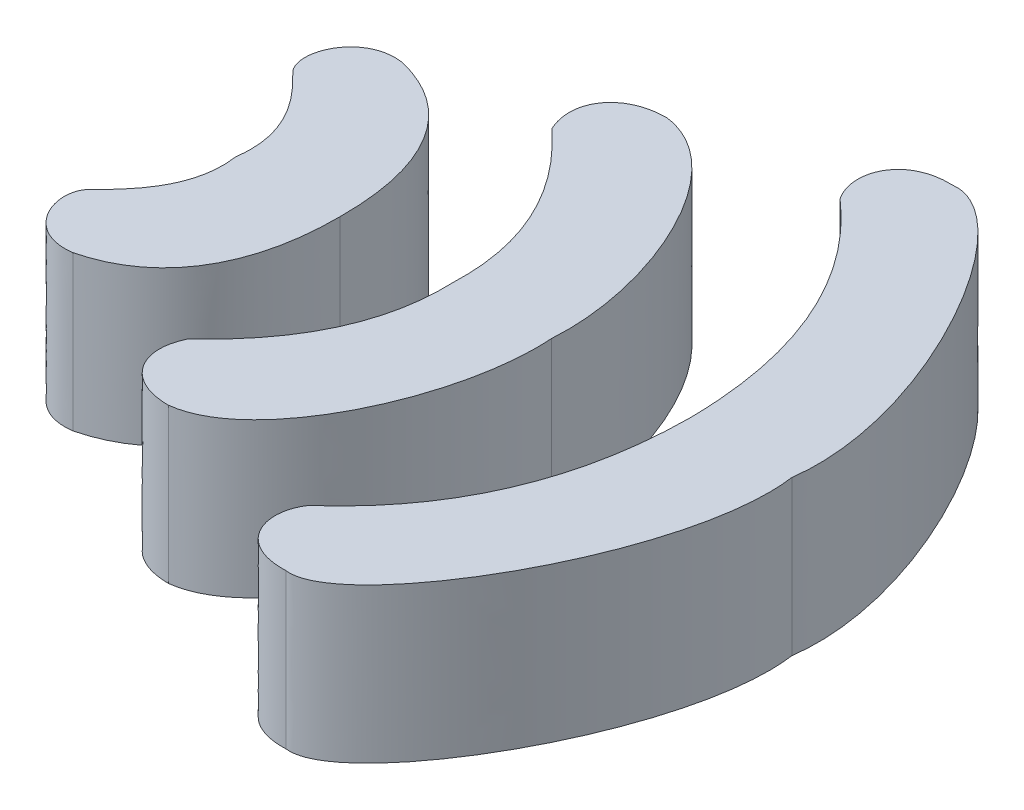
ISO-10303-21;
HEADER;
FILE_DESCRIPTION(('STEP AP214'),'2;1');
FILE_NAME('part.step','',(''),(''),'','','');
FILE_SCHEMA(('AUTOMOTIVE_DESIGN { 1 0 10303 214 1 1 1 1 }'));
ENDSEC;
DATA;
#1=APPLICATION_CONTEXT('core data for automotive mechanical design processes');
#2=APPLICATION_PROTOCOL_DEFINITION('international standard','automotive_design',2000,#1);
#3=PRODUCT_CONTEXT('',#1,'mechanical');
#4=PRODUCT('Part','Part','',(#3));
#5=PRODUCT_RELATED_PRODUCT_CATEGORY('part','',(#4));
#6=PRODUCT_DEFINITION_FORMATION('','',#4);
#7=PRODUCT_DEFINITION_CONTEXT('part definition',#1,'design');
#8=PRODUCT_DEFINITION('design','',#6,#7);
#9=PRODUCT_DEFINITION_SHAPE('','',#8);
#10=(LENGTH_UNIT() NAMED_UNIT(*) SI_UNIT(.MILLI.,.METRE.));
#11=(NAMED_UNIT(*) PLANE_ANGLE_UNIT() SI_UNIT($,.RADIAN.));
#12=(NAMED_UNIT(*) SI_UNIT($,.STERADIAN.) SOLID_ANGLE_UNIT());
#13=UNCERTAINTY_MEASURE_WITH_UNIT(LENGTH_MEASURE(1.E-05),#10,'distance_accuracy_value','');
#14=(GEOMETRIC_REPRESENTATION_CONTEXT(3) GLOBAL_UNCERTAINTY_ASSIGNED_CONTEXT((#13)) GLOBAL_UNIT_ASSIGNED_CONTEXT((#10,
#11,#12)) REPRESENTATION_CONTEXT('',''));
#15=CARTESIAN_POINT('',(0.,0.,0.));
#16=DIRECTION('',(0.,0.,1.));
#17=DIRECTION('',(1.,0.,0.));
#18=AXIS2_PLACEMENT_3D('',#15,#16,#17);
#19=CARTESIAN_POINT('',(7.42126006215926,2.,-5.05579621304999));
#20=CARTESIAN_POINT('',(7.41057557473069,2.,-3.71253404907121));
#21=CARTESIAN_POINT('',(6.96757511777548,2.,-2.52001163881642));
#22=CARTESIAN_POINT('',(5.93694367861275,2.,-1.61821471098783));
#23=B_SPLINE_CURVE_WITH_KNOTS('',3,(#19,#20,#21,#22),.UNSPECIFIED.,.F.,.F.,(4,4),(0.,1.),.UNSPECIFIED.);
#24=DIRECTION('',(0.,-1.,0.));
#25=VECTOR('',#24,1.);
#26=SURFACE_OF_LINEAR_EXTRUSION('',#23,#25);
#27=CARTESIAN_POINT('',(7.42126006215926,0.,-5.05579621304999));
#28=CARTESIAN_POINT('',(7.41057557473069,0.,-3.71253404907121));
#29=CARTESIAN_POINT('',(6.96757511777548,0.,-2.52001163881642));
#30=CARTESIAN_POINT('',(5.93694367861275,0.,-1.61821471098783));
#31=B_SPLINE_CURVE_WITH_KNOTS('',3,(#27,#28,#29,#30),.UNSPECIFIED.,.F.,.F.,(4,4),(0.,1.),.UNSPECIFIED.);
#32=CARTESIAN_POINT('',(7.42126006215926,0.,-5.05579621304999));
#33=VERTEX_POINT('',#32);
#34=CARTESIAN_POINT('',(5.93694367861275,0.,-1.61821471098783));
#35=VERTEX_POINT('',#34);
#36=EDGE_CURVE('E196',#33,#35,#31,.T.);
#37=ORIENTED_EDGE('',*,*,#36,.T.);
#38=DIRECTION('',(0.,-1.,0.));
#39=VECTOR('',#38,1.);
#40=CARTESIAN_POINT('',(5.93694367861275,2.,-1.61821471098783));
#41=LINE('',#40,#39);
#42=CARTESIAN_POINT('',(5.93694367861275,2.,-1.61821471098783));
#43=VERTEX_POINT('',#42);
#44=EDGE_CURVE('E12',#43,#35,#41,.T.);
#45=ORIENTED_EDGE('',*,*,#44,.F.);
#46=CARTESIAN_POINT('',(7.42126006215926,2.,-5.05579621304999));
#47=VERTEX_POINT('',#46);
#48=EDGE_CURVE('E163',#47,#43,#23,.T.);
#49=ORIENTED_EDGE('',*,*,#48,.F.);
#50=DIRECTION('',(0.,-1.,0.));
#51=VECTOR('',#50,1.);
#52=CARTESIAN_POINT('',(7.42126006215926,2.,-5.05579621304999));
#53=LINE('',#52,#51);
#54=EDGE_CURVE('E125',#47,#33,#53,.T.);
#55=ORIENTED_EDGE('',*,*,#54,.T.);
#56=EDGE_LOOP('',(#37,#45,#49,#55));
#57=FACE_BOUND('',#56,.T.);
#58=ADVANCED_FACE('F44',(#57),#26,.F.);
#59=CARTESIAN_POINT('',(5.93694367861275,2.,-1.61821471098783));
#60=CARTESIAN_POINT('',(5.68837602403387,2.,-1.25804337357399));
#61=CARTESIAN_POINT('',(5.87142631166735,2.,-0.707481676595686));
#62=CARTESIAN_POINT('',(6.52004995803424,2.,-0.73432807119694));
#63=B_SPLINE_CURVE_WITH_KNOTS('',3,(#59,#60,#61,#62),.UNSPECIFIED.,.F.,.F.,(4,4),(0.,1.),.UNSPECIFIED.);
#64=DIRECTION('',(0.,-1.,0.));
#65=VECTOR('',#64,1.);
#66=SURFACE_OF_LINEAR_EXTRUSION('',#63,#65);
#67=CARTESIAN_POINT('',(5.93694367861275,0.,-1.61821471098783));
#68=CARTESIAN_POINT('',(5.68837602403387,0.,-1.25804337357399));
#69=CARTESIAN_POINT('',(5.87142631166735,0.,-0.707481676595686));
#70=CARTESIAN_POINT('',(6.52004995803424,0.,-0.73432807119694));
#71=B_SPLINE_CURVE_WITH_KNOTS('',3,(#67,#68,#69,#70),.UNSPECIFIED.,.F.,.F.,(4,4),(0.,1.),.UNSPECIFIED.);
#72=CARTESIAN_POINT('',(6.52004995803424,0.,-0.73432807119694));
#73=VERTEX_POINT('',#72);
#74=EDGE_CURVE('E194',#35,#73,#71,.T.);
#75=ORIENTED_EDGE('',*,*,#74,.T.);
#76=DIRECTION('',(0.,-1.,0.));
#77=VECTOR('',#76,1.);
#78=CARTESIAN_POINT('',(6.52004995803424,2.,-0.73432807119694));
#79=LINE('',#78,#77);
#80=CARTESIAN_POINT('',(6.52004995803424,2.,-0.73432807119694));
#81=VERTEX_POINT('',#80);
#82=EDGE_CURVE('E53',#81,#73,#79,.T.);
#83=ORIENTED_EDGE('',*,*,#82,.F.);
#84=EDGE_CURVE('E98',#43,#81,#63,.T.);
#85=ORIENTED_EDGE('',*,*,#84,.F.);
#86=ORIENTED_EDGE('',*,*,#44,.T.);
#87=EDGE_LOOP('',(#75,#83,#85,#86));
#88=FACE_BOUND('',#87,.T.);
#89=ADVANCED_FACE('F151',(#88),#66,.F.);
#90=CARTESIAN_POINT('',(6.52004995803424,2.,-0.73432807119694));
#91=CARTESIAN_POINT('',(7.33799488998139,2.,-0.629332836639139));
#92=CARTESIAN_POINT('',(8.97470412590936,2.,-3.45586760643739));
#93=CARTESIAN_POINT('',(8.74932735164435,2.,-5.05579621304999));
#94=B_SPLINE_CURVE_WITH_KNOTS('',3,(#90,#91,#92,#93),.UNSPECIFIED.,.F.,.F.,(4,4),(0.,1.),.UNSPECIFIED.);
#95=DIRECTION('',(0.,-1.,0.));
#96=VECTOR('',#95,1.);
#97=SURFACE_OF_LINEAR_EXTRUSION('',#94,#96);
#98=CARTESIAN_POINT('',(6.52004995803424,0.,-0.73432807119694));
#99=CARTESIAN_POINT('',(7.33799488998139,0.,-0.629332836639139));
#100=CARTESIAN_POINT('',(8.97470412590936,0.,-3.45586760643739));
#101=CARTESIAN_POINT('',(8.74932735164435,0.,-5.05579621304999));
#102=B_SPLINE_CURVE_WITH_KNOTS('',3,(#98,#99,#100,#101),.UNSPECIFIED.,.F.,.F.,(4,4),(0.,1.),.UNSPECIFIED.);
#103=CARTESIAN_POINT('',(8.74932735164435,0.,-5.05579621304999));
#104=VERTEX_POINT('',#103);
#105=EDGE_CURVE('E190',#73,#104,#102,.T.);
#106=ORIENTED_EDGE('',*,*,#105,.T.);
#107=DIRECTION('',(0.,-1.,0.));
#108=VECTOR('',#107,1.);
#109=CARTESIAN_POINT('',(8.74932735164435,2.,-5.05579621304999));
#110=LINE('',#109,#108);
#111=CARTESIAN_POINT('',(8.74932735164435,2.,-5.05579621304999));
#112=VERTEX_POINT('',#111);
#113=EDGE_CURVE('E120',#112,#104,#110,.T.);
#114=ORIENTED_EDGE('',*,*,#113,.F.);
#115=EDGE_CURVE('E111',#81,#112,#94,.T.);
#116=ORIENTED_EDGE('',*,*,#115,.F.);
#117=ORIENTED_EDGE('',*,*,#82,.T.);
#118=EDGE_LOOP('',(#106,#114,#116,#117));
#119=FACE_BOUND('',#118,.T.);
#120=ADVANCED_FACE('F149',(#119),#97,.F.);
#121=CARTESIAN_POINT('',(8.74932735164435,2.,-5.05579621304999));
#122=CARTESIAN_POINT('',(8.97470412590936,2.,-6.6557248196626));
#123=CARTESIAN_POINT('',(7.33799488998139,2.,-9.48225958946085));
#124=CARTESIAN_POINT('',(6.52004995803424,2.,-9.37726435490305));
#125=B_SPLINE_CURVE_WITH_KNOTS('',3,(#121,#122,#123,#124),.UNSPECIFIED.,.F.,.F.,(4,4),(0.,1.),.UNSPECIFIED.);
#126=DIRECTION('',(0.,-1.,0.));
#127=VECTOR('',#126,1.);
#128=SURFACE_OF_LINEAR_EXTRUSION('',#125,#127);
#129=CARTESIAN_POINT('',(8.74932735164435,0.,-5.05579621304999));
#130=CARTESIAN_POINT('',(8.97470412590936,0.,-6.6557248196626));
#131=CARTESIAN_POINT('',(7.33799488998139,0.,-9.48225958946085));
#132=CARTESIAN_POINT('',(6.52004995803424,0.,-9.37726435490305));
#133=B_SPLINE_CURVE_WITH_KNOTS('',3,(#129,#130,#131,#132),.UNSPECIFIED.,.F.,.F.,(4,4),(0.,1.),.UNSPECIFIED.);
#134=CARTESIAN_POINT('',(6.52004995803424,0.,-9.37726435490305));
#135=VERTEX_POINT('',#134);
#136=EDGE_CURVE('E119',#104,#135,#133,.T.);
#137=ORIENTED_EDGE('',*,*,#136,.T.);
#138=DIRECTION('',(0.,-1.,0.));
#139=VECTOR('',#138,1.);
#140=CARTESIAN_POINT('',(6.52004995803424,2.,-9.37726435490305));
#141=LINE('',#140,#139);
#142=CARTESIAN_POINT('',(6.52004995803424,2.,-9.37726435490305));
#143=VERTEX_POINT('',#142);
#144=EDGE_CURVE('E116',#143,#135,#141,.T.);
#145=ORIENTED_EDGE('',*,*,#144,.F.);
#146=EDGE_CURVE('E105',#112,#143,#125,.T.);
#147=ORIENTED_EDGE('',*,*,#146,.F.);
#148=ORIENTED_EDGE('',*,*,#113,.T.);
#149=EDGE_LOOP('',(#137,#145,#147,#148));
#150=FACE_BOUND('',#149,.T.);
#151=ADVANCED_FACE('F117',(#150),#128,.F.);
#152=CARTESIAN_POINT('',(6.52004995803424,2.,-9.37726435490305));
#153=CARTESIAN_POINT('',(5.87142631166735,2.,-9.4041107495043));
#154=CARTESIAN_POINT('',(5.68837602403387,2.,-8.853549052526));
#155=CARTESIAN_POINT('',(5.93694367861275,2.,-8.49337771511216));
#156=B_SPLINE_CURVE_WITH_KNOTS('',3,(#152,#153,#154,#155),.UNSPECIFIED.,.F.,.F.,(4,4),(0.,1.),.UNSPECIFIED.);
#157=DIRECTION('',(0.,-1.,0.));
#158=VECTOR('',#157,1.);
#159=SURFACE_OF_LINEAR_EXTRUSION('',#156,#158);
#160=CARTESIAN_POINT('',(6.52004995803424,0.,-9.37726435490305));
#161=CARTESIAN_POINT('',(5.87142631166735,0.,-9.4041107495043));
#162=CARTESIAN_POINT('',(5.68837602403387,0.,-8.853549052526));
#163=CARTESIAN_POINT('',(5.93694367861275,0.,-8.49337771511216));
#164=B_SPLINE_CURVE_WITH_KNOTS('',3,(#160,#161,#162,#163),.UNSPECIFIED.,.F.,.F.,(4,4),(0.,1.),.UNSPECIFIED.);
#165=CARTESIAN_POINT('',(5.93694367861275,0.,-8.49337771511216));
#166=VERTEX_POINT('',#165);
#167=EDGE_CURVE('E84',#135,#166,#164,.T.);
#168=ORIENTED_EDGE('',*,*,#167,.T.);
#169=DIRECTION('',(0.,-1.,0.));
#170=VECTOR('',#169,1.);
#171=CARTESIAN_POINT('',(5.93694367861275,2.,-8.49337771511216));
#172=LINE('',#171,#170);
#173=CARTESIAN_POINT('',(5.93694367861275,2.,-8.49337771511216));
#174=VERTEX_POINT('',#173);
#175=EDGE_CURVE('E121',#174,#166,#172,.T.);
#176=ORIENTED_EDGE('',*,*,#175,.F.);
#177=EDGE_CURVE('E109',#143,#174,#156,.T.);
#178=ORIENTED_EDGE('',*,*,#177,.F.);
#179=ORIENTED_EDGE('',*,*,#144,.T.);
#180=EDGE_LOOP('',(#168,#176,#178,#179));
#181=FACE_BOUND('',#180,.T.);
#182=ADVANCED_FACE('F123',(#181),#159,.F.);
#183=CARTESIAN_POINT('',(5.93694367861275,2.,-8.49337771511216));
#184=CARTESIAN_POINT('',(6.96757511777548,2.,-7.59158078728357));
#185=CARTESIAN_POINT('',(7.41057557473069,2.,-6.39905837702878));
#186=CARTESIAN_POINT('',(7.42126006215926,2.,-5.05579621304999));
#187=B_SPLINE_CURVE_WITH_KNOTS('',3,(#183,#184,#185,#186),.UNSPECIFIED.,.F.,.F.,(4,4),(0.,1.),.UNSPECIFIED.);
#188=DIRECTION('',(0.,-1.,0.));
#189=VECTOR('',#188,1.);
#190=SURFACE_OF_LINEAR_EXTRUSION('',#187,#189);
#191=CARTESIAN_POINT('',(5.93694367861275,0.,-8.49337771511216));
#192=CARTESIAN_POINT('',(6.96757511777548,0.,-7.59158078728357));
#193=CARTESIAN_POINT('',(7.41057557473069,0.,-6.39905837702878));
#194=CARTESIAN_POINT('',(7.42126006215926,0.,-5.05579621304999));
#195=B_SPLINE_CURVE_WITH_KNOTS('',3,(#191,#192,#193,#194),.UNSPECIFIED.,.F.,.F.,(4,4),(0.,1.),.UNSPECIFIED.);
#196=EDGE_CURVE('E90',#166,#33,#195,.T.);
#197=ORIENTED_EDGE('',*,*,#196,.T.);
#198=ORIENTED_EDGE('',*,*,#54,.F.);
#199=EDGE_CURVE('E61',#174,#47,#187,.T.);
#200=ORIENTED_EDGE('',*,*,#199,.F.);
#201=ORIENTED_EDGE('',*,*,#175,.T.);
#202=EDGE_LOOP('',(#197,#198,#200,#201));
#203=FACE_BOUND('',#202,.T.);
#204=ADVANCED_FACE('F145',(#203),#190,.F.);
#205=CARTESIAN_POINT('',(7.06158197728632,2.,-3.17145599846259));
#206=DIRECTION('',(0.,1.,0.));
#207=DIRECTION('',(0.,0.,1.));
#208=AXIS2_PLACEMENT_3D('',#205,#206,#207);
#209=PLANE('',#208);
#210=ORIENTED_EDGE('',*,*,#48,.T.);
#211=ORIENTED_EDGE('',*,*,#84,.T.);
#212=ORIENTED_EDGE('',*,*,#115,.T.);
#213=ORIENTED_EDGE('',*,*,#146,.T.);
#214=ORIENTED_EDGE('',*,*,#177,.T.);
#215=ORIENTED_EDGE('',*,*,#199,.T.);
#216=EDGE_LOOP('',(#210,#211,#212,#213,#214,#215));
#217=FACE_BOUND('',#216,.T.);
#218=ADVANCED_FACE('F107',(#217),#209,.T.);
#219=CARTESIAN_POINT('',(7.06158197728632,0.,-3.17145599846259));
#220=DIRECTION('',(0.,1.,0.));
#221=DIRECTION('',(0.,0.,1.));
#222=AXIS2_PLACEMENT_3D('',#219,#220,#221);
#223=PLANE('',#222);
#224=ORIENTED_EDGE('',*,*,#36,.F.);
#225=ORIENTED_EDGE('',*,*,#196,.F.);
#226=ORIENTED_EDGE('',*,*,#167,.F.);
#227=ORIENTED_EDGE('',*,*,#136,.F.);
#228=ORIENTED_EDGE('',*,*,#105,.F.);
#229=ORIENTED_EDGE('',*,*,#74,.F.);
#230=EDGE_LOOP('',(#224,#225,#226,#227,#228,#229));
#231=FACE_BOUND('',#230,.T.);
#232=ADVANCED_FACE('F193',(#231),#223,.F.);
#233=CLOSED_SHELL('',(#58,#89,#120,#151,#182,#204,#218,#232));
#234=MANIFOLD_SOLID_BREP('B2',#233);
#235=CARTESIAN_POINT('',(4.36730758516548,2.,-5.05579621304999));
#236=CARTESIAN_POINT('',(4.41984399193228,2.,-3.74128085615372));
#237=CARTESIAN_POINT('',(3.28504414887366,2.,-2.70125176324062));
#238=B_SPLINE_CURVE_WITH_KNOTS('',2,(#235,#236,#237),.UNSPECIFIED.,.F.,.F.,(3,3),(0.,1.),.UNSPECIFIED.);
#239=DIRECTION('',(0.,-1.,0.));
#240=VECTOR('',#239,1.);
#241=SURFACE_OF_LINEAR_EXTRUSION('',#238,#240);
#242=CARTESIAN_POINT('',(4.36730758516548,0.,-5.05579621304999));
#243=CARTESIAN_POINT('',(4.41984399193228,0.,-3.74128085615372));
#244=CARTESIAN_POINT('',(3.28504414887366,0.,-2.70125176324062));
#245=B_SPLINE_CURVE_WITH_KNOTS('',2,(#242,#243,#244),.UNSPECIFIED.,.F.,.F.,(3,3),(0.,1.),.UNSPECIFIED.);
#246=CARTESIAN_POINT('',(4.36730758516548,0.,-5.05579621304999));
#247=VERTEX_POINT('',#246);
#248=CARTESIAN_POINT('',(3.28504414887366,0.,-2.70125176324062));
#249=VERTEX_POINT('',#248);
#250=EDGE_CURVE('E447',#247,#249,#245,.T.);
#251=ORIENTED_EDGE('',*,*,#250,.T.);
#252=DIRECTION('',(0.,-1.,0.));
#253=VECTOR('',#252,1.);
#254=CARTESIAN_POINT('',(3.28504414887366,2.,-2.70125176324062));
#255=LINE('',#254,#253);
#256=CARTESIAN_POINT('',(3.28504414887366,2.,-2.70125176324062));
#257=VERTEX_POINT('',#256);
#258=EDGE_CURVE('E42',#257,#249,#255,.T.);
#259=ORIENTED_EDGE('',*,*,#258,.F.);
#260=CARTESIAN_POINT('',(4.36730758516548,2.,-5.05579621304999));
#261=VERTEX_POINT('',#260);
#262=EDGE_CURVE('E414',#261,#257,#238,.T.);
#263=ORIENTED_EDGE('',*,*,#262,.F.);
#264=DIRECTION('',(0.,-1.,0.));
#265=VECTOR('',#264,1.);
#266=CARTESIAN_POINT('',(4.36730758516548,2.,-5.05579621304999));
#267=LINE('',#266,#265);
#268=EDGE_CURVE('E376',#261,#247,#267,.T.);
#269=ORIENTED_EDGE('',*,*,#268,.T.);
#270=EDGE_LOOP('',(#251,#259,#263,#269));
#271=FACE_BOUND('',#270,.T.);
#272=ADVANCED_FACE('F295',(#271),#241,.F.);
#273=CARTESIAN_POINT('',(3.28504414887366,2.,-2.70125176324062));
#274=CARTESIAN_POINT('',(3.06833247927146,2.,-2.25469438345427));
#275=CARTESIAN_POINT('',(3.34808862089066,2.,-1.82913656700546));
#276=CARTESIAN_POINT('',(3.8997277510394,2.,-1.82913656700546));
#277=B_SPLINE_CURVE_WITH_KNOTS('',3,(#273,#274,#275,#276),.UNSPECIFIED.,.F.,.F.,(4,4),(0.,1.),.UNSPECIFIED.);
#278=DIRECTION('',(0.,-1.,0.));
#279=VECTOR('',#278,1.);
#280=SURFACE_OF_LINEAR_EXTRUSION('',#277,#279);
#281=CARTESIAN_POINT('',(3.28504414887366,0.,-2.70125176324062));
#282=CARTESIAN_POINT('',(3.06833247927146,0.,-2.25469438345427));
#283=CARTESIAN_POINT('',(3.34808862089066,0.,-1.82913656700546));
#284=CARTESIAN_POINT('',(3.8997277510394,0.,-1.82913656700546));
#285=B_SPLINE_CURVE_WITH_KNOTS('',3,(#281,#282,#283,#284),.UNSPECIFIED.,.F.,.F.,(4,4),(0.,1.),.UNSPECIFIED.);
#286=CARTESIAN_POINT('',(3.8997277510394,0.,-1.82913656700546));
#287=VERTEX_POINT('',#286);
#288=EDGE_CURVE('E445',#249,#287,#285,.T.);
#289=ORIENTED_EDGE('',*,*,#288,.T.);
#290=DIRECTION('',(0.,-1.,0.));
#291=VECTOR('',#290,1.);
#292=CARTESIAN_POINT('',(3.8997277510394,2.,-1.82913656700546));
#293=LINE('',#292,#291);
#294=CARTESIAN_POINT('',(3.8997277510394,2.,-1.82913656700546));
#295=VERTEX_POINT('',#294);
#296=EDGE_CURVE('E304',#295,#287,#293,.T.);
#297=ORIENTED_EDGE('',*,*,#296,.F.);
#298=EDGE_CURVE('E349',#257,#295,#277,.T.);
#299=ORIENTED_EDGE('',*,*,#298,.F.);
#300=ORIENTED_EDGE('',*,*,#258,.T.);
#301=EDGE_LOOP('',(#289,#297,#299,#300));
#302=FACE_BOUND('',#301,.T.);
#303=ADVANCED_FACE('F402',(#302),#280,.F.);
#304=CARTESIAN_POINT('',(3.8997277510394,2.,-1.82913656700546));
#305=CARTESIAN_POINT('',(4.89136448649187,2.,-1.9407777888776));
#306=CARTESIAN_POINT('',(5.72538935576346,2.,-3.79381846514349));
#307=CARTESIAN_POINT('',(5.63345073150689,2.,-5.05579621304999));
#308=B_SPLINE_CURVE_WITH_KNOTS('',3,(#304,#305,#306,#307),.UNSPECIFIED.,.F.,.F.,(4,4),(0.,1.),.UNSPECIFIED.);
#309=DIRECTION('',(0.,-1.,0.));
#310=VECTOR('',#309,1.);
#311=SURFACE_OF_LINEAR_EXTRUSION('',#308,#310);
#312=CARTESIAN_POINT('',(3.8997277510394,0.,-1.82913656700546));
#313=CARTESIAN_POINT('',(4.89136448649187,0.,-1.9407777888776));
#314=CARTESIAN_POINT('',(5.72538935576346,0.,-3.79381846514349));
#315=CARTESIAN_POINT('',(5.63345073150689,0.,-5.05579621304999));
#316=B_SPLINE_CURVE_WITH_KNOTS('',3,(#312,#313,#314,#315),.UNSPECIFIED.,.F.,.F.,(4,4),(0.,1.),.UNSPECIFIED.);
#317=CARTESIAN_POINT('',(5.63345073150689,0.,-5.05579621304999));
#318=VERTEX_POINT('',#317);
#319=EDGE_CURVE('E441',#287,#318,#316,.T.);
#320=ORIENTED_EDGE('',*,*,#319,.T.);
#321=DIRECTION('',(0.,-1.,0.));
#322=VECTOR('',#321,1.);
#323=CARTESIAN_POINT('',(5.63345073150689,2.,-5.05579621304999));
#324=LINE('',#323,#322);
#325=CARTESIAN_POINT('',(5.63345073150689,2.,-5.05579621304999));
#326=VERTEX_POINT('',#325);
#327=EDGE_CURVE('E371',#326,#318,#324,.T.);
#328=ORIENTED_EDGE('',*,*,#327,.F.);
#329=EDGE_CURVE('E362',#295,#326,#308,.T.);
#330=ORIENTED_EDGE('',*,*,#329,.F.);
#331=ORIENTED_EDGE('',*,*,#296,.T.);
#332=EDGE_LOOP('',(#320,#328,#330,#331));
#333=FACE_BOUND('',#332,.T.);
#334=ADVANCED_FACE('F400',(#333),#311,.F.);
#335=CARTESIAN_POINT('',(5.63345073150689,2.,-5.05579621304999));
#336=CARTESIAN_POINT('',(5.72538935576346,2.,-6.3177739609565));
#337=CARTESIAN_POINT('',(4.89136448649187,2.,-8.17081463722239));
#338=CARTESIAN_POINT('',(3.8997277510394,2.,-8.28245585909452));
#339=B_SPLINE_CURVE_WITH_KNOTS('',3,(#335,#336,#337,#338),.UNSPECIFIED.,.F.,.F.,(4,4),(0.,1.),.UNSPECIFIED.);
#340=DIRECTION('',(0.,-1.,0.));
#341=VECTOR('',#340,1.);
#342=SURFACE_OF_LINEAR_EXTRUSION('',#339,#341);
#343=CARTESIAN_POINT('',(5.63345073150689,0.,-5.05579621304999));
#344=CARTESIAN_POINT('',(5.72538935576346,0.,-6.3177739609565));
#345=CARTESIAN_POINT('',(4.89136448649187,0.,-8.17081463722239));
#346=CARTESIAN_POINT('',(3.8997277510394,0.,-8.28245585909452));
#347=B_SPLINE_CURVE_WITH_KNOTS('',3,(#343,#344,#345,#346),.UNSPECIFIED.,.F.,.F.,(4,4),(0.,1.),.UNSPECIFIED.);
#348=CARTESIAN_POINT('',(3.89972775103941,0.,-8.28245585909453));
#349=VERTEX_POINT('',#348);
#350=EDGE_CURVE('E370',#318,#349,#347,.T.);
#351=ORIENTED_EDGE('',*,*,#350,.T.);
#352=DIRECTION('',(0.,-1.,0.));
#353=VECTOR('',#352,1.);
#354=CARTESIAN_POINT('',(3.89972775103941,2.,-8.28245585909453));
#355=LINE('',#354,#353);
#356=CARTESIAN_POINT('',(3.89972775103941,2.,-8.28245585909453));
#357=VERTEX_POINT('',#356);
#358=EDGE_CURVE('E367',#357,#349,#355,.T.);
#359=ORIENTED_EDGE('',*,*,#358,.F.);
#360=EDGE_CURVE('E356',#326,#357,#339,.T.);
#361=ORIENTED_EDGE('',*,*,#360,.F.);
#362=ORIENTED_EDGE('',*,*,#327,.T.);
#363=EDGE_LOOP('',(#351,#359,#361,#362));
#364=FACE_BOUND('',#363,.T.);
#365=ADVANCED_FACE('F368',(#364),#342,.F.);
#366=CARTESIAN_POINT('',(3.89972775103941,2.,-8.28245585909453));
#367=CARTESIAN_POINT('',(3.34808862089066,2.,-8.28245585909453));
#368=CARTESIAN_POINT('',(3.06833247927146,2.,-7.85689804264572));
#369=CARTESIAN_POINT('',(3.28504414887366,2.,-7.41034066285937));
#370=B_SPLINE_CURVE_WITH_KNOTS('',3,(#366,#367,#368,#369),.UNSPECIFIED.,.F.,.F.,(4,4),(0.,1.),.UNSPECIFIED.);
#371=DIRECTION('',(0.,-1.,0.));
#372=VECTOR('',#371,1.);
#373=SURFACE_OF_LINEAR_EXTRUSION('',#370,#372);
#374=CARTESIAN_POINT('',(3.89972775103941,0.,-8.28245585909453));
#375=CARTESIAN_POINT('',(3.34808862089066,0.,-8.28245585909453));
#376=CARTESIAN_POINT('',(3.06833247927146,0.,-7.85689804264572));
#377=CARTESIAN_POINT('',(3.28504414887366,0.,-7.41034066285937));
#378=B_SPLINE_CURVE_WITH_KNOTS('',3,(#374,#375,#376,#377),.UNSPECIFIED.,.F.,.F.,(4,4),(0.,1.),.UNSPECIFIED.);
#379=CARTESIAN_POINT('',(3.28504414887366,0.,-7.41034066285937));
#380=VERTEX_POINT('',#379);
#381=EDGE_CURVE('E335',#349,#380,#378,.T.);
#382=ORIENTED_EDGE('',*,*,#381,.T.);
#383=DIRECTION('',(0.,-1.,0.));
#384=VECTOR('',#383,1.);
#385=CARTESIAN_POINT('',(3.28504414887366,2.,-7.41034066285937));
#386=LINE('',#385,#384);
#387=CARTESIAN_POINT('',(3.28504414887366,2.,-7.41034066285937));
#388=VERTEX_POINT('',#387);
#389=EDGE_CURVE('E372',#388,#380,#386,.T.);
#390=ORIENTED_EDGE('',*,*,#389,.F.);
#391=EDGE_CURVE('E360',#357,#388,#370,.T.);
#392=ORIENTED_EDGE('',*,*,#391,.F.);
#393=ORIENTED_EDGE('',*,*,#358,.T.);
#394=EDGE_LOOP('',(#382,#390,#392,#393));
#395=FACE_BOUND('',#394,.T.);
#396=ADVANCED_FACE('F374',(#395),#373,.F.);
#397=CARTESIAN_POINT('',(3.28504414887366,2.,-7.41034066285937));
#398=CARTESIAN_POINT('',(4.41984399193228,2.,-6.37031156994627));
#399=CARTESIAN_POINT('',(4.36730758516548,2.,-5.05579621304999));
#400=B_SPLINE_CURVE_WITH_KNOTS('',2,(#397,#398,#399),.UNSPECIFIED.,.F.,.F.,(3,3),(0.,1.),.UNSPECIFIED.);
#401=DIRECTION('',(0.,-1.,0.));
#402=VECTOR('',#401,1.);
#403=SURFACE_OF_LINEAR_EXTRUSION('',#400,#402);
#404=CARTESIAN_POINT('',(3.28504414887366,0.,-7.41034066285937));
#405=CARTESIAN_POINT('',(4.41984399193228,0.,-6.37031156994627));
#406=CARTESIAN_POINT('',(4.36730758516548,0.,-5.05579621304999));
#407=B_SPLINE_CURVE_WITH_KNOTS('',2,(#404,#405,#406),.UNSPECIFIED.,.F.,.F.,(3,3),(0.,1.),.UNSPECIFIED.);
#408=EDGE_CURVE('E341',#380,#247,#407,.T.);
#409=ORIENTED_EDGE('',*,*,#408,.T.);
#410=ORIENTED_EDGE('',*,*,#268,.F.);
#411=EDGE_CURVE('E312',#388,#261,#400,.T.);
#412=ORIENTED_EDGE('',*,*,#411,.F.);
#413=ORIENTED_EDGE('',*,*,#389,.T.);
#414=EDGE_LOOP('',(#409,#410,#412,#413));
#415=FACE_BOUND('',#414,.T.);
#416=ADVANCED_FACE('F396',(#415),#403,.F.);
#417=CARTESIAN_POINT('',(4.12300992947593,2.,-3.80990242214951));
#418=DIRECTION('',(0.,1.,0.));
#419=DIRECTION('',(0.,0.,1.));
#420=AXIS2_PLACEMENT_3D('',#417,#418,#419);
#421=PLANE('',#420);
#422=ORIENTED_EDGE('',*,*,#262,.T.);
#423=ORIENTED_EDGE('',*,*,#298,.T.);
#424=ORIENTED_EDGE('',*,*,#329,.T.);
#425=ORIENTED_EDGE('',*,*,#360,.T.);
#426=ORIENTED_EDGE('',*,*,#391,.T.);
#427=ORIENTED_EDGE('',*,*,#411,.T.);
#428=EDGE_LOOP('',(#422,#423,#424,#425,#426,#427));
#429=FACE_BOUND('',#428,.T.);
#430=ADVANCED_FACE('F358',(#429),#421,.T.);
#431=CARTESIAN_POINT('',(4.12300992947593,0.,-3.80990242214951));
#432=DIRECTION('',(0.,1.,0.));
#433=DIRECTION('',(0.,0.,1.));
#434=AXIS2_PLACEMENT_3D('',#431,#432,#433);
#435=PLANE('',#434);
#436=ORIENTED_EDGE('',*,*,#250,.F.);
#437=ORIENTED_EDGE('',*,*,#408,.F.);
#438=ORIENTED_EDGE('',*,*,#381,.F.);
#439=ORIENTED_EDGE('',*,*,#350,.F.);
#440=ORIENTED_EDGE('',*,*,#319,.F.);
#441=ORIENTED_EDGE('',*,*,#288,.F.);
#442=EDGE_LOOP('',(#436,#437,#438,#439,#440,#441));
#443=FACE_BOUND('',#442,.T.);
#444=ADVANCED_FACE('F444',(#443),#435,.F.);
#445=CLOSED_SHELL('',(#272,#303,#334,#365,#396,#416,#430,#444));
#446=MANIFOLD_SOLID_BREP('B6',#445);
#447=CARTESIAN_POINT('',(1.54993415974209,2.,-5.05579621304999));
#448=CARTESIAN_POINT('',(1.62959004086381,2.,-4.49786530878208));
#449=CARTESIAN_POINT('',(1.3381750835579,2.,-4.08877174981827));
#450=CARTESIAN_POINT('',(0.964073922717159,2.,-3.73528583753349));
#451=B_SPLINE_CURVE_WITH_KNOTS('',3,(#447,#448,#449,#450),.UNSPECIFIED.,.F.,.F.,(4,4),(0.,1.),.UNSPECIFIED.);
#452=DIRECTION('',(0.,-1.,0.));
#453=VECTOR('',#452,1.);
#454=SURFACE_OF_LINEAR_EXTRUSION('',#451,#453);
#455=CARTESIAN_POINT('',(1.54993415974209,0.,-5.05579621304999));
#456=CARTESIAN_POINT('',(1.62959004086381,0.,-4.49786530878208));
#457=CARTESIAN_POINT('',(1.3381750835579,0.,-4.08877174981827));
#458=CARTESIAN_POINT('',(0.964073922717159,0.,-3.73528583753349));
#459=B_SPLINE_CURVE_WITH_KNOTS('',3,(#455,#456,#457,#458),.UNSPECIFIED.,.F.,.F.,(4,4),(0.,1.),.UNSPECIFIED.);
#460=CARTESIAN_POINT('',(1.54993415974209,0.,-5.05579621304999));
#461=VERTEX_POINT('',#460);
#462=CARTESIAN_POINT('',(0.964073922717159,0.,-3.73528583753349));
#463=VERTEX_POINT('',#462);
#464=EDGE_CURVE('E689',#461,#463,#459,.T.);
#465=ORIENTED_EDGE('',*,*,#464,.T.);
#466=DIRECTION('',(0.,-1.,0.));
#467=VECTOR('',#466,1.);
#468=CARTESIAN_POINT('',(0.964073922717159,2.,-3.73528583753349));
#469=LINE('',#468,#467);
#470=CARTESIAN_POINT('',(0.964073922717159,2.,-3.73528583753349));
#471=VERTEX_POINT('',#470);
#472=EDGE_CURVE('E293',#471,#463,#469,.T.);
#473=ORIENTED_EDGE('',*,*,#472,.F.);
#474=CARTESIAN_POINT('',(1.54993415974209,2.,-5.05579621304999));
#475=VERTEX_POINT('',#474);
#476=EDGE_CURVE('E656',#475,#471,#451,.T.);
#477=ORIENTED_EDGE('',*,*,#476,.F.);
#478=DIRECTION('',(0.,-1.,0.));
#479=VECTOR('',#478,1.);
#480=CARTESIAN_POINT('',(1.54993415974209,2.,-5.05579621304999));
#481=LINE('',#480,#479);
#482=EDGE_CURVE('E618',#475,#461,#481,.T.);
#483=ORIENTED_EDGE('',*,*,#482,.T.);
#484=EDGE_LOOP('',(#465,#473,#477,#483));
#485=FACE_BOUND('',#484,.T.);
#486=ADVANCED_FACE('F537',(#485),#454,.F.);
#487=CARTESIAN_POINT('',(0.964073922717159,2.,-3.73528583753349));
#488=CARTESIAN_POINT('',(0.739819164524981,2.,-3.48203792568676));
#489=CARTESIAN_POINT('',(0.99723178441693,2.,-2.83844406355187));
#490=CARTESIAN_POINT('',(1.5710955340504,2.,-2.92205335157794));
#491=B_SPLINE_CURVE_WITH_KNOTS('',3,(#487,#488,#489,#490),.UNSPECIFIED.,.F.,.F.,(4,4),(0.,1.),.UNSPECIFIED.);
#492=DIRECTION('',(0.,-1.,0.));
#493=VECTOR('',#492,1.);
#494=SURFACE_OF_LINEAR_EXTRUSION('',#491,#493);
#495=CARTESIAN_POINT('',(0.964073922717159,0.,-3.73528583753349));
#496=CARTESIAN_POINT('',(0.739819164524981,0.,-3.48203792568676));
#497=CARTESIAN_POINT('',(0.99723178441693,0.,-2.83844406355187));
#498=CARTESIAN_POINT('',(1.5710955340504,0.,-2.92205335157794));
#499=B_SPLINE_CURVE_WITH_KNOTS('',3,(#495,#496,#497,#498),.UNSPECIFIED.,.F.,.F.,(4,4),(0.,1.),.UNSPECIFIED.);
#500=CARTESIAN_POINT('',(1.5710955340504,0.,-2.92205335157794));
#501=VERTEX_POINT('',#500);
#502=EDGE_CURVE('E687',#463,#501,#499,.T.);
#503=ORIENTED_EDGE('',*,*,#502,.T.);
#504=DIRECTION('',(0.,-1.,0.));
#505=VECTOR('',#504,1.);
#506=CARTESIAN_POINT('',(1.5710955340504,2.,-2.92205335157794));
#507=LINE('',#506,#505);
#508=CARTESIAN_POINT('',(1.5710955340504,2.,-2.92205335157794));
#509=VERTEX_POINT('',#508);
#510=EDGE_CURVE('E546',#509,#501,#507,.T.);
#511=ORIENTED_EDGE('',*,*,#510,.F.);
#512=EDGE_CURVE('E591',#471,#509,#491,.T.);
#513=ORIENTED_EDGE('',*,*,#512,.F.);
#514=ORIENTED_EDGE('',*,*,#472,.T.);
#515=EDGE_LOOP('',(#503,#511,#513,#514));
#516=FACE_BOUND('',#515,.T.);
#517=ADVANCED_FACE('F644',(#516),#494,.F.);
#518=CARTESIAN_POINT('',(1.5710955340504,2.,-2.92205335157794));
#519=CARTESIAN_POINT('',(2.50599938904159,2.,-3.15387910423836));
#520=CARTESIAN_POINT('',(2.90428421713154,2.,-3.99215987244797));
#521=CARTESIAN_POINT('',(2.89668339088931,2.,-5.05579621305));
#522=B_SPLINE_CURVE_WITH_KNOTS('',3,(#518,#519,#520,#521),.UNSPECIFIED.,.F.,.F.,(4,4),(0.,1.),.UNSPECIFIED.);
#523=DIRECTION('',(0.,-1.,0.));
#524=VECTOR('',#523,1.);
#525=SURFACE_OF_LINEAR_EXTRUSION('',#522,#524);
#526=CARTESIAN_POINT('',(1.5710955340504,0.,-2.92205335157794));
#527=CARTESIAN_POINT('',(2.50599938904159,0.,-3.15387910423836));
#528=CARTESIAN_POINT('',(2.90428421713154,0.,-3.99215987244797));
#529=CARTESIAN_POINT('',(2.89668339088931,0.,-5.05579621305));
#530=B_SPLINE_CURVE_WITH_KNOTS('',3,(#526,#527,#528,#529),.UNSPECIFIED.,.F.,.F.,(4,4),(0.,1.),.UNSPECIFIED.);
#531=CARTESIAN_POINT('',(2.89668339088931,0.,-5.05579621304999));
#532=VERTEX_POINT('',#531);
#533=EDGE_CURVE('E683',#501,#532,#530,.T.);
#534=ORIENTED_EDGE('',*,*,#533,.T.);
#535=DIRECTION('',(0.,-1.,0.));
#536=VECTOR('',#535,1.);
#537=CARTESIAN_POINT('',(2.89668339088931,2.,-5.05579621304999));
#538=LINE('',#537,#536);
#539=CARTESIAN_POINT('',(2.89668339088931,2.,-5.05579621304999));
#540=VERTEX_POINT('',#539);
#541=EDGE_CURVE('E613',#540,#532,#538,.T.);
#542=ORIENTED_EDGE('',*,*,#541,.F.);
#543=EDGE_CURVE('E604',#509,#540,#522,.T.);
#544=ORIENTED_EDGE('',*,*,#543,.F.);
#545=ORIENTED_EDGE('',*,*,#510,.T.);
#546=EDGE_LOOP('',(#534,#542,#544,#545));
#547=FACE_BOUND('',#546,.T.);
#548=ADVANCED_FACE('F642',(#547),#525,.F.);
#549=CARTESIAN_POINT('',(2.89668339088931,2.,-5.05579621304999));
#550=CARTESIAN_POINT('',(2.90428421713154,2.,-6.11943255365202));
#551=CARTESIAN_POINT('',(2.50599938904159,2.,-6.95771332186163));
#552=CARTESIAN_POINT('',(1.5710955340504,2.,-7.18953907452205));
#553=B_SPLINE_CURVE_WITH_KNOTS('',3,(#549,#550,#551,#552),.UNSPECIFIED.,.F.,.F.,(4,4),(0.,1.),.UNSPECIFIED.);
#554=DIRECTION('',(0.,-1.,0.));
#555=VECTOR('',#554,1.);
#556=SURFACE_OF_LINEAR_EXTRUSION('',#553,#555);
#557=CARTESIAN_POINT('',(2.89668339088931,0.,-5.05579621304999));
#558=CARTESIAN_POINT('',(2.90428421713154,0.,-6.11943255365202));
#559=CARTESIAN_POINT('',(2.50599938904159,0.,-6.95771332186163));
#560=CARTESIAN_POINT('',(1.5710955340504,0.,-7.18953907452205));
#561=B_SPLINE_CURVE_WITH_KNOTS('',3,(#557,#558,#559,#560),.UNSPECIFIED.,.F.,.F.,(4,4),(0.,1.),.UNSPECIFIED.);
#562=CARTESIAN_POINT('',(1.5710955340504,0.,-7.18953907452205));
#563=VERTEX_POINT('',#562);
#564=EDGE_CURVE('E612',#532,#563,#561,.T.);
#565=ORIENTED_EDGE('',*,*,#564,.T.);
#566=DIRECTION('',(0.,-1.,0.));
#567=VECTOR('',#566,1.);
#568=CARTESIAN_POINT('',(1.5710955340504,2.,-7.18953907452205));
#569=LINE('',#568,#567);
#570=CARTESIAN_POINT('',(1.5710955340504,2.,-7.18953907452205));
#571=VERTEX_POINT('',#570);
#572=EDGE_CURVE('E609',#571,#563,#569,.T.);
#573=ORIENTED_EDGE('',*,*,#572,.F.);
#574=EDGE_CURVE('E598',#540,#571,#553,.T.);
#575=ORIENTED_EDGE('',*,*,#574,.F.);
#576=ORIENTED_EDGE('',*,*,#541,.T.);
#577=EDGE_LOOP('',(#565,#573,#575,#576));
#578=FACE_BOUND('',#577,.T.);
#579=ADVANCED_FACE('F610',(#578),#556,.F.);
#580=CARTESIAN_POINT('',(1.5710955340504,2.,-7.18953907452205));
#581=CARTESIAN_POINT('',(0.99723178441693,2.,-7.27314836254812));
#582=CARTESIAN_POINT('',(0.739819164524981,2.,-6.62955450041323));
#583=CARTESIAN_POINT('',(0.964073922717159,2.,-6.3763065885665));
#584=B_SPLINE_CURVE_WITH_KNOTS('',3,(#580,#581,#582,#583),.UNSPECIFIED.,.F.,.F.,(4,4),(0.,1.),.UNSPECIFIED.);
#585=DIRECTION('',(0.,-1.,0.));
#586=VECTOR('',#585,1.);
#587=SURFACE_OF_LINEAR_EXTRUSION('',#584,#586);
#588=CARTESIAN_POINT('',(1.5710955340504,0.,-7.18953907452205));
#589=CARTESIAN_POINT('',(0.99723178441693,0.,-7.27314836254812));
#590=CARTESIAN_POINT('',(0.739819164524981,0.,-6.62955450041323));
#591=CARTESIAN_POINT('',(0.964073922717159,0.,-6.3763065885665));
#592=B_SPLINE_CURVE_WITH_KNOTS('',3,(#588,#589,#590,#591),.UNSPECIFIED.,.F.,.F.,(4,4),(0.,1.),.UNSPECIFIED.);
#593=CARTESIAN_POINT('',(0.964073922717159,0.,-6.3763065885665));
#594=VERTEX_POINT('',#593);
#595=EDGE_CURVE('E577',#563,#594,#592,.T.);
#596=ORIENTED_EDGE('',*,*,#595,.T.);
#597=DIRECTION('',(0.,-1.,0.));
#598=VECTOR('',#597,1.);
#599=CARTESIAN_POINT('',(0.964073922717159,2.,-6.3763065885665));
#600=LINE('',#599,#598);
#601=CARTESIAN_POINT('',(0.964073922717159,2.,-6.3763065885665));
#602=VERTEX_POINT('',#601);
#603=EDGE_CURVE('E614',#602,#594,#600,.T.);
#604=ORIENTED_EDGE('',*,*,#603,.F.);
#605=EDGE_CURVE('E602',#571,#602,#584,.T.);
#606=ORIENTED_EDGE('',*,*,#605,.F.);
#607=ORIENTED_EDGE('',*,*,#572,.T.);
#608=EDGE_LOOP('',(#596,#604,#606,#607));
#609=FACE_BOUND('',#608,.T.);
#610=ADVANCED_FACE('F616',(#609),#587,.F.);
#611=CARTESIAN_POINT('',(0.964073922717159,2.,-6.3763065885665));
#612=CARTESIAN_POINT('',(1.3381750835579,2.,-6.02282067628172));
#613=CARTESIAN_POINT('',(1.62959004086381,2.,-5.61372711731791));
#614=CARTESIAN_POINT('',(1.54993415974209,2.,-5.05579621304999));
#615=B_SPLINE_CURVE_WITH_KNOTS('',3,(#611,#612,#613,#614),.UNSPECIFIED.,.F.,.F.,(4,4),(0.,1.),.UNSPECIFIED.);
#616=DIRECTION('',(0.,-1.,0.));
#617=VECTOR('',#616,1.);
#618=SURFACE_OF_LINEAR_EXTRUSION('',#615,#617);
#619=CARTESIAN_POINT('',(0.964073922717159,0.,-6.3763065885665));
#620=CARTESIAN_POINT('',(1.3381750835579,0.,-6.02282067628172));
#621=CARTESIAN_POINT('',(1.62959004086381,0.,-5.61372711731791));
#622=CARTESIAN_POINT('',(1.54993415974209,0.,-5.05579621304999));
#623=B_SPLINE_CURVE_WITH_KNOTS('',3,(#619,#620,#621,#622),.UNSPECIFIED.,.F.,.F.,(4,4),(0.,1.),.UNSPECIFIED.);
#624=EDGE_CURVE('E583',#594,#461,#623,.T.);
#625=ORIENTED_EDGE('',*,*,#624,.T.);
#626=ORIENTED_EDGE('',*,*,#482,.F.);
#627=EDGE_CURVE('E554',#602,#475,#615,.T.);
#628=ORIENTED_EDGE('',*,*,#627,.F.);
#629=ORIENTED_EDGE('',*,*,#603,.T.);
#630=EDGE_LOOP('',(#625,#626,#628,#629));
#631=FACE_BOUND('',#630,.T.);
#632=ADVANCED_FACE('F638',(#631),#618,.F.);
#633=CARTESIAN_POINT('',(1.42716293196555,2.,-4.31887415329807));
#634=DIRECTION('',(0.,-1.,0.));
#635=DIRECTION('',(0.,0.,-1.));
#636=AXIS2_PLACEMENT_3D('',#633,#634,#635);
#637=PLANE('',#636);
#638=ORIENTED_EDGE('',*,*,#476,.T.);
#639=ORIENTED_EDGE('',*,*,#512,.T.);
#640=ORIENTED_EDGE('',*,*,#543,.T.);
#641=ORIENTED_EDGE('',*,*,#574,.T.);
#642=ORIENTED_EDGE('',*,*,#605,.T.);
#643=ORIENTED_EDGE('',*,*,#627,.T.);
#644=EDGE_LOOP('',(#638,#639,#640,#641,#642,#643));
#645=FACE_BOUND('',#644,.T.);
#646=ADVANCED_FACE('F600',(#645),#637,.F.);
#647=CARTESIAN_POINT('',(1.42716293196555,0.,-4.31887415329807));
#648=DIRECTION('',(0.,-1.,0.));
#649=DIRECTION('',(0.,0.,-1.));
#650=AXIS2_PLACEMENT_3D('',#647,#648,#649);
#651=PLANE('',#650);
#652=ORIENTED_EDGE('',*,*,#464,.F.);
#653=ORIENTED_EDGE('',*,*,#624,.F.);
#654=ORIENTED_EDGE('',*,*,#595,.F.);
#655=ORIENTED_EDGE('',*,*,#564,.F.);
#656=ORIENTED_EDGE('',*,*,#533,.F.);
#657=ORIENTED_EDGE('',*,*,#502,.F.);
#658=EDGE_LOOP('',(#652,#653,#654,#655,#656,#657));
#659=FACE_BOUND('',#658,.T.);
#660=ADVANCED_FACE('F686',(#659),#651,.T.);
#661=CLOSED_SHELL('',(#486,#517,#548,#579,#610,#632,#646,#660));
#662=MANIFOLD_SOLID_BREP('B36',#661);
#663=ADVANCED_BREP_SHAPE_REPRESENTATION('',(#18,#234,#446,#662),#14);
#664=SHAPE_DEFINITION_REPRESENTATION(#9,#663);
ENDSEC;
END-ISO-10303-21;
